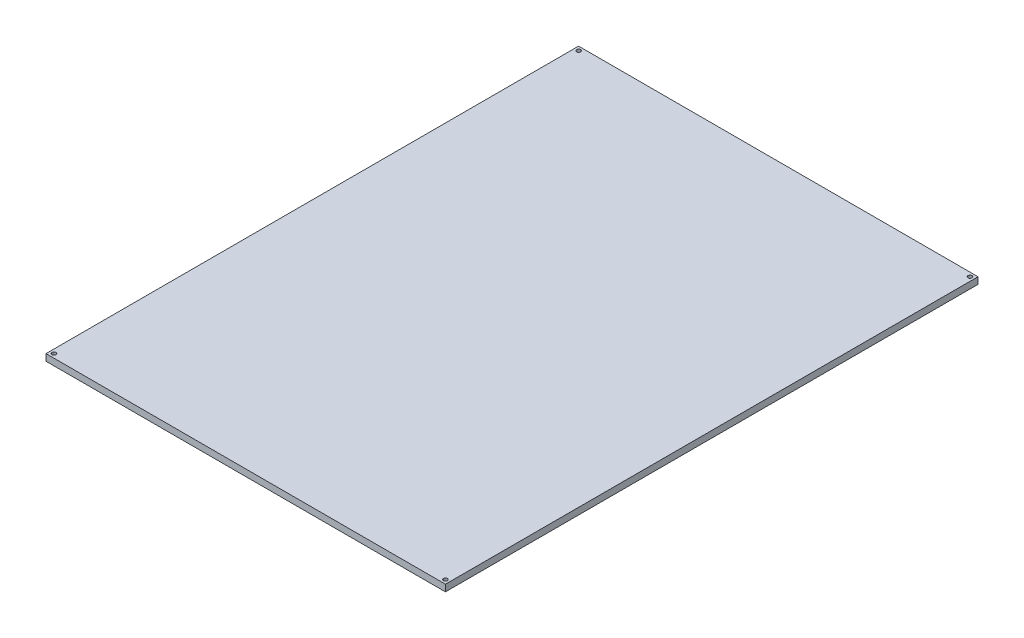
ISO-10303-21;
HEADER;
FILE_DESCRIPTION(('STEP AP214'),'2;1');
FILE_NAME('part.step','',(''),(''),'','','');
FILE_SCHEMA(('AUTOMOTIVE_DESIGN { 1 0 10303 214 1 1 1 1 }'));
ENDSEC;
DATA;
#1=APPLICATION_CONTEXT('core data for automotive mechanical design processes');
#2=APPLICATION_PROTOCOL_DEFINITION('international standard','automotive_design',2000,#1);
#3=PRODUCT_CONTEXT('',#1,'mechanical');
#4=PRODUCT('Part','Part','',(#3));
#5=PRODUCT_RELATED_PRODUCT_CATEGORY('part','',(#4));
#6=PRODUCT_DEFINITION_FORMATION('','',#4);
#7=PRODUCT_DEFINITION_CONTEXT('part definition',#1,'design');
#8=PRODUCT_DEFINITION('design','',#6,#7);
#9=PRODUCT_DEFINITION_SHAPE('','',#8);
#10=(LENGTH_UNIT() NAMED_UNIT(*) SI_UNIT(.MILLI.,.METRE.));
#11=(NAMED_UNIT(*) PLANE_ANGLE_UNIT() SI_UNIT($,.RADIAN.));
#12=(NAMED_UNIT(*) SI_UNIT($,.STERADIAN.) SOLID_ANGLE_UNIT());
#13=UNCERTAINTY_MEASURE_WITH_UNIT(LENGTH_MEASURE(1.E-05),#10,'distance_accuracy_value','');
#14=(GEOMETRIC_REPRESENTATION_CONTEXT(3) GLOBAL_UNCERTAINTY_ASSIGNED_CONTEXT((#13)) GLOBAL_UNIT_ASSIGNED_CONTEXT((#10,
#11,#12)) REPRESENTATION_CONTEXT('',''));
#15=CARTESIAN_POINT('',(0.,0.,0.));
#16=DIRECTION('',(0.,0.,1.));
#17=DIRECTION('',(1.,0.,0.));
#18=AXIS2_PLACEMENT_3D('',#15,#16,#17);
#19=CARTESIAN_POINT('',(-150.,5.,200.));
#20=DIRECTION('',(1.,0.,0.));
#21=DIRECTION('',(0.,0.,-1.));
#22=AXIS2_PLACEMENT_3D('',#19,#20,#21);
#23=PLANE('',#22);
#24=DIRECTION('',(0.,0.,1.));
#25=VECTOR('',#24,1.);
#26=CARTESIAN_POINT('',(-150.,0.,200.));
#27=LINE('',#26,#25);
#28=CARTESIAN_POINT('',(-150.,0.,-200.));
#29=VERTEX_POINT('',#28);
#30=CARTESIAN_POINT('',(-150.,0.,200.));
#31=VERTEX_POINT('',#30);
#32=EDGE_CURVE('E97',#29,#31,#27,.T.);
#33=ORIENTED_EDGE('',*,*,#32,.T.);
#34=DIRECTION('',(0.,-1.,0.));
#35=VECTOR('',#34,1.);
#36=CARTESIAN_POINT('',(-150.,5.,200.));
#37=LINE('',#36,#35);
#38=CARTESIAN_POINT('',(-150.,5.,200.));
#39=VERTEX_POINT('',#38);
#40=EDGE_CURVE('E11',#39,#31,#37,.T.);
#41=ORIENTED_EDGE('',*,*,#40,.F.);
#42=DIRECTION('',(0.,0.,1.));
#43=VECTOR('',#42,1.);
#44=CARTESIAN_POINT('',(-150.,5.,200.));
#45=LINE('',#44,#43);
#46=CARTESIAN_POINT('',(-150.,5.,-200.));
#47=VERTEX_POINT('',#46);
#48=EDGE_CURVE('E85',#47,#39,#45,.T.);
#49=ORIENTED_EDGE('',*,*,#48,.F.);
#50=DIRECTION('',(0.,-1.,0.));
#51=VECTOR('',#50,1.);
#52=CARTESIAN_POINT('',(-150.,5.,-200.));
#53=LINE('',#52,#51);
#54=EDGE_CURVE('E93',#47,#29,#53,.T.);
#55=ORIENTED_EDGE('',*,*,#54,.T.);
#56=EDGE_LOOP('',(#33,#41,#49,#55));
#57=FACE_BOUND('',#56,.T.);
#58=ADVANCED_FACE('F34',(#57),#23,.F.);
#59=CARTESIAN_POINT('',(-150.,5.,200.));
#60=DIRECTION('',(0.,0.,-1.));
#61=DIRECTION('',(-1.,0.,0.));
#62=AXIS2_PLACEMENT_3D('',#59,#60,#61);
#63=PLANE('',#62);
#64=DIRECTION('',(1.,0.,0.));
#65=VECTOR('',#64,1.);
#66=CARTESIAN_POINT('',(-150.,0.,200.));
#67=LINE('',#66,#65);
#68=CARTESIAN_POINT('',(150.,0.,200.));
#69=VERTEX_POINT('',#68);
#70=EDGE_CURVE('E89',#31,#69,#67,.T.);
#71=ORIENTED_EDGE('',*,*,#70,.T.);
#72=DIRECTION('',(0.,-1.,0.));
#73=VECTOR('',#72,1.);
#74=CARTESIAN_POINT('',(150.,5.,200.));
#75=LINE('',#74,#73);
#76=CARTESIAN_POINT('',(150.,5.,200.));
#77=VERTEX_POINT('',#76);
#78=EDGE_CURVE('E42',#77,#69,#75,.T.);
#79=ORIENTED_EDGE('',*,*,#78,.F.);
#80=DIRECTION('',(1.,0.,0.));
#81=VECTOR('',#80,1.);
#82=CARTESIAN_POINT('',(-150.,5.,200.));
#83=LINE('',#82,#81);
#84=EDGE_CURVE('E80',#39,#77,#83,.T.);
#85=ORIENTED_EDGE('',*,*,#84,.F.);
#86=ORIENTED_EDGE('',*,*,#40,.T.);
#87=EDGE_LOOP('',(#71,#79,#85,#86));
#88=FACE_BOUND('',#87,.T.);
#89=ADVANCED_FACE('F88',(#88),#63,.F.);
#90=CARTESIAN_POINT('',(150.,5.,200.));
#91=DIRECTION('',(-1.,0.,0.));
#92=DIRECTION('',(0.,0.,1.));
#93=AXIS2_PLACEMENT_3D('',#90,#91,#92);
#94=PLANE('',#93);
#95=DIRECTION('',(0.,0.,-1.));
#96=VECTOR('',#95,1.);
#97=CARTESIAN_POINT('',(150.,0.,200.));
#98=LINE('',#97,#96);
#99=CARTESIAN_POINT('',(150.,0.,-200.));
#100=VERTEX_POINT('',#99);
#101=EDGE_CURVE('E67',#69,#100,#98,.T.);
#102=ORIENTED_EDGE('',*,*,#101,.T.);
#103=DIRECTION('',(0.,-1.,0.));
#104=VECTOR('',#103,1.);
#105=CARTESIAN_POINT('',(150.,5.,-200.));
#106=LINE('',#105,#104);
#107=CARTESIAN_POINT('',(150.,5.,-200.));
#108=VERTEX_POINT('',#107);
#109=EDGE_CURVE('E90',#108,#100,#106,.T.);
#110=ORIENTED_EDGE('',*,*,#109,.F.);
#111=DIRECTION('',(0.,0.,-1.));
#112=VECTOR('',#111,1.);
#113=CARTESIAN_POINT('',(150.,5.,200.));
#114=LINE('',#113,#112);
#115=EDGE_CURVE('E83',#77,#108,#114,.T.);
#116=ORIENTED_EDGE('',*,*,#115,.F.);
#117=ORIENTED_EDGE('',*,*,#78,.T.);
#118=EDGE_LOOP('',(#102,#110,#116,#117));
#119=FACE_BOUND('',#118,.T.);
#120=ADVANCED_FACE('F91',(#119),#94,.F.);
#121=CARTESIAN_POINT('',(-150.,5.,-200.));
#122=DIRECTION('',(0.,0.,1.));
#123=DIRECTION('',(1.,0.,0.));
#124=AXIS2_PLACEMENT_3D('',#121,#122,#123);
#125=PLANE('',#124);
#126=DIRECTION('',(-1.,0.,0.));
#127=VECTOR('',#126,1.);
#128=CARTESIAN_POINT('',(-150.,0.,-200.));
#129=LINE('',#128,#127);
#130=EDGE_CURVE('E73',#100,#29,#129,.T.);
#131=ORIENTED_EDGE('',*,*,#130,.T.);
#132=ORIENTED_EDGE('',*,*,#54,.F.);
#133=DIRECTION('',(-1.,0.,0.));
#134=VECTOR('',#133,1.);
#135=CARTESIAN_POINT('',(-150.,5.,-200.));
#136=LINE('',#135,#134);
#137=EDGE_CURVE('E50',#108,#47,#136,.T.);
#138=ORIENTED_EDGE('',*,*,#137,.F.);
#139=ORIENTED_EDGE('',*,*,#109,.T.);
#140=EDGE_LOOP('',(#131,#132,#138,#139));
#141=FACE_BOUND('',#140,.T.);
#142=ADVANCED_FACE('F105',(#141),#125,.F.);
#143=CARTESIAN_POINT('',(0.,5.,0.));
#144=DIRECTION('',(0.,-1.,0.));
#145=DIRECTION('',(0.,0.,-1.));
#146=AXIS2_PLACEMENT_3D('',#143,#144,#145);
#147=PLANE('',#146);
#148=CARTESIAN_POINT('',(147.,5.,-197.));
#149=DIRECTION('',(0.,1.,0.));
#150=DIRECTION('',(0.,0.,1.));
#151=AXIS2_PLACEMENT_3D('',#148,#149,#150);
#152=CIRCLE('',#151,1.50000000000002);
#153=CARTESIAN_POINT('',(147.,5.,-195.5));
#154=VERTEX_POINT('',#153);
#155=EDGE_CURVE('E129',#154,#154,#152,.T.);
#156=ORIENTED_EDGE('',*,*,#155,.F.);
#157=EDGE_LOOP('',(#156));
#158=FACE_BOUND('',#157,.T.);
#159=CARTESIAN_POINT('',(-146.999999999996,5.,197.));
#160=DIRECTION('',(0.,1.,0.));
#161=DIRECTION('',(0.,0.,1.));
#162=AXIS2_PLACEMENT_3D('',#159,#160,#161);
#163=CIRCLE('',#162,1.50000000000002);
#164=CARTESIAN_POINT('',(-146.999999999996,5.,198.5));
#165=VERTEX_POINT('',#164);
#166=EDGE_CURVE('E123',#165,#165,#163,.T.);
#167=ORIENTED_EDGE('',*,*,#166,.F.);
#168=EDGE_LOOP('',(#167));
#169=FACE_BOUND('',#168,.T.);
#170=CARTESIAN_POINT('',(147.000000000004,5.,197.));
#171=DIRECTION('',(0.,1.,0.));
#172=DIRECTION('',(0.,0.,1.));
#173=AXIS2_PLACEMENT_3D('',#170,#171,#172);
#174=CIRCLE('',#173,1.50000000000002);
#175=CARTESIAN_POINT('',(147.000000000004,5.,198.5));
#176=VERTEX_POINT('',#175);
#177=EDGE_CURVE('E117',#176,#176,#174,.T.);
#178=ORIENTED_EDGE('',*,*,#177,.F.);
#179=EDGE_LOOP('',(#178));
#180=FACE_BOUND('',#179,.T.);
#181=CARTESIAN_POINT('',(-147.,5.,-197.));
#182=DIRECTION('',(0.,1.,0.));
#183=DIRECTION('',(0.,0.,1.));
#184=AXIS2_PLACEMENT_3D('',#181,#182,#183);
#185=CIRCLE('',#184,1.50000000000002);
#186=CARTESIAN_POINT('',(-147.,5.,-195.5));
#187=VERTEX_POINT('',#186);
#188=EDGE_CURVE('E111',#187,#187,#185,.T.);
#189=ORIENTED_EDGE('',*,*,#188,.F.);
#190=EDGE_LOOP('',(#189));
#191=FACE_BOUND('',#190,.T.);
#192=ORIENTED_EDGE('',*,*,#48,.T.);
#193=ORIENTED_EDGE('',*,*,#84,.T.);
#194=ORIENTED_EDGE('',*,*,#115,.T.);
#195=ORIENTED_EDGE('',*,*,#137,.T.);
#196=EDGE_LOOP('',(#192,#193,#194,#195));
#197=FACE_BOUND('',#196,.T.);
#198=ADVANCED_FACE('F81',(#158,#169,#180,#191,#197),#147,.F.);
#199=CARTESIAN_POINT('',(0.,0.,0.));
#200=DIRECTION('',(0.,-1.,0.));
#201=DIRECTION('',(0.,0.,-1.));
#202=AXIS2_PLACEMENT_3D('',#199,#200,#201);
#203=PLANE('',#202);
#204=CARTESIAN_POINT('',(147.,0.,-197.));
#205=DIRECTION('',(0.,1.,0.));
#206=DIRECTION('',(0.,0.,1.));
#207=AXIS2_PLACEMENT_3D('',#204,#205,#206);
#208=CIRCLE('',#207,1.50000000000002);
#209=CARTESIAN_POINT('',(147.,0.,-195.5));
#210=VERTEX_POINT('',#209);
#211=EDGE_CURVE('E114',#210,#210,#208,.T.);
#212=ORIENTED_EDGE('',*,*,#211,.T.);
#213=EDGE_LOOP('',(#212));
#214=FACE_BOUND('',#213,.T.);
#215=CARTESIAN_POINT('',(-146.999999999996,0.,197.));
#216=DIRECTION('',(0.,1.,0.));
#217=DIRECTION('',(0.,0.,1.));
#218=AXIS2_PLACEMENT_3D('',#215,#216,#217);
#219=CIRCLE('',#218,1.50000000000002);
#220=CARTESIAN_POINT('',(-146.999999999996,0.,198.5));
#221=VERTEX_POINT('',#220);
#222=EDGE_CURVE('E126',#221,#221,#219,.T.);
#223=ORIENTED_EDGE('',*,*,#222,.T.);
#224=EDGE_LOOP('',(#223));
#225=FACE_BOUND('',#224,.T.);
#226=CARTESIAN_POINT('',(147.000000000004,0.,197.));
#227=DIRECTION('',(0.,1.,0.));
#228=DIRECTION('',(0.,0.,1.));
#229=AXIS2_PLACEMENT_3D('',#226,#227,#228);
#230=CIRCLE('',#229,1.50000000000002);
#231=CARTESIAN_POINT('',(147.000000000004,0.,198.5));
#232=VERTEX_POINT('',#231);
#233=EDGE_CURVE('E120',#232,#232,#230,.T.);
#234=ORIENTED_EDGE('',*,*,#233,.T.);
#235=EDGE_LOOP('',(#234));
#236=FACE_BOUND('',#235,.T.);
#237=CARTESIAN_POINT('',(-147.,0.,-197.));
#238=DIRECTION('',(0.,1.,0.));
#239=DIRECTION('',(0.,0.,1.));
#240=AXIS2_PLACEMENT_3D('',#237,#238,#239);
#241=CIRCLE('',#240,1.50000000000002);
#242=CARTESIAN_POINT('',(-147.,0.,-195.5));
#243=VERTEX_POINT('',#242);
#244=EDGE_CURVE('E100',#243,#243,#241,.T.);
#245=ORIENTED_EDGE('',*,*,#244,.T.);
#246=EDGE_LOOP('',(#245));
#247=FACE_BOUND('',#246,.T.);
#248=ORIENTED_EDGE('',*,*,#32,.F.);
#249=ORIENTED_EDGE('',*,*,#130,.F.);
#250=ORIENTED_EDGE('',*,*,#101,.F.);
#251=ORIENTED_EDGE('',*,*,#70,.F.);
#252=EDGE_LOOP('',(#248,#249,#250,#251));
#253=FACE_BOUND('',#252,.T.);
#254=ADVANCED_FACE('F108',(#214,#225,#236,#247,#253),#203,.T.);
#255=CARTESIAN_POINT('',(-147.,0.,-197.));
#256=DIRECTION('',(0.,1.,0.));
#257=DIRECTION('',(0.,0.,1.));
#258=AXIS2_PLACEMENT_3D('',#255,#256,#257);
#259=CYLINDRICAL_SURFACE('',#258,1.50000000000002);
#260=ORIENTED_EDGE('',*,*,#244,.F.);
#261=EDGE_LOOP('',(#260));
#262=FACE_BOUND('',#261,.T.);
#263=ORIENTED_EDGE('',*,*,#188,.T.);
#264=EDGE_LOOP('',(#263));
#265=FACE_BOUND('',#264,.T.);
#266=ADVANCED_FACE('F153',(#262,#265),#259,.F.);
#267=CARTESIAN_POINT('',(147.000000000004,0.,197.));
#268=DIRECTION('',(0.,1.,0.));
#269=DIRECTION('',(0.,0.,1.));
#270=AXIS2_PLACEMENT_3D('',#267,#268,#269);
#271=CYLINDRICAL_SURFACE('',#270,1.50000000000002);
#272=ORIENTED_EDGE('',*,*,#233,.F.);
#273=EDGE_LOOP('',(#272));
#274=FACE_BOUND('',#273,.T.);
#275=ORIENTED_EDGE('',*,*,#177,.T.);
#276=EDGE_LOOP('',(#275));
#277=FACE_BOUND('',#276,.T.);
#278=ADVANCED_FACE('F155',(#274,#277),#271,.F.);
#279=CARTESIAN_POINT('',(-146.999999999996,0.,197.));
#280=DIRECTION('',(0.,1.,0.));
#281=DIRECTION('',(0.,0.,1.));
#282=AXIS2_PLACEMENT_3D('',#279,#280,#281);
#283=CYLINDRICAL_SURFACE('',#282,1.50000000000002);
#284=ORIENTED_EDGE('',*,*,#222,.F.);
#285=EDGE_LOOP('',(#284));
#286=FACE_BOUND('',#285,.T.);
#287=ORIENTED_EDGE('',*,*,#166,.T.);
#288=EDGE_LOOP('',(#287));
#289=FACE_BOUND('',#288,.T.);
#290=ADVANCED_FACE('F140',(#286,#289),#283,.F.);
#291=CARTESIAN_POINT('',(147.,0.,-197.));
#292=DIRECTION('',(0.,1.,0.));
#293=DIRECTION('',(0.,0.,1.));
#294=AXIS2_PLACEMENT_3D('',#291,#292,#293);
#295=CYLINDRICAL_SURFACE('',#294,1.50000000000002);
#296=ORIENTED_EDGE('',*,*,#211,.F.);
#297=EDGE_LOOP('',(#296));
#298=FACE_BOUND('',#297,.T.);
#299=ORIENTED_EDGE('',*,*,#155,.T.);
#300=EDGE_LOOP('',(#299));
#301=FACE_BOUND('',#300,.T.);
#302=ADVANCED_FACE('F137',(#298,#301),#295,.F.);
#303=CLOSED_SHELL('',(#58,#89,#120,#142,#198,#254,#266,#278,#290,#302));
#304=MANIFOLD_SOLID_BREP('B2',#303);
#305=ADVANCED_BREP_SHAPE_REPRESENTATION('',(#18,#304),#14);
#306=SHAPE_DEFINITION_REPRESENTATION(#9,#305);
ENDSEC;
END-ISO-10303-21;
